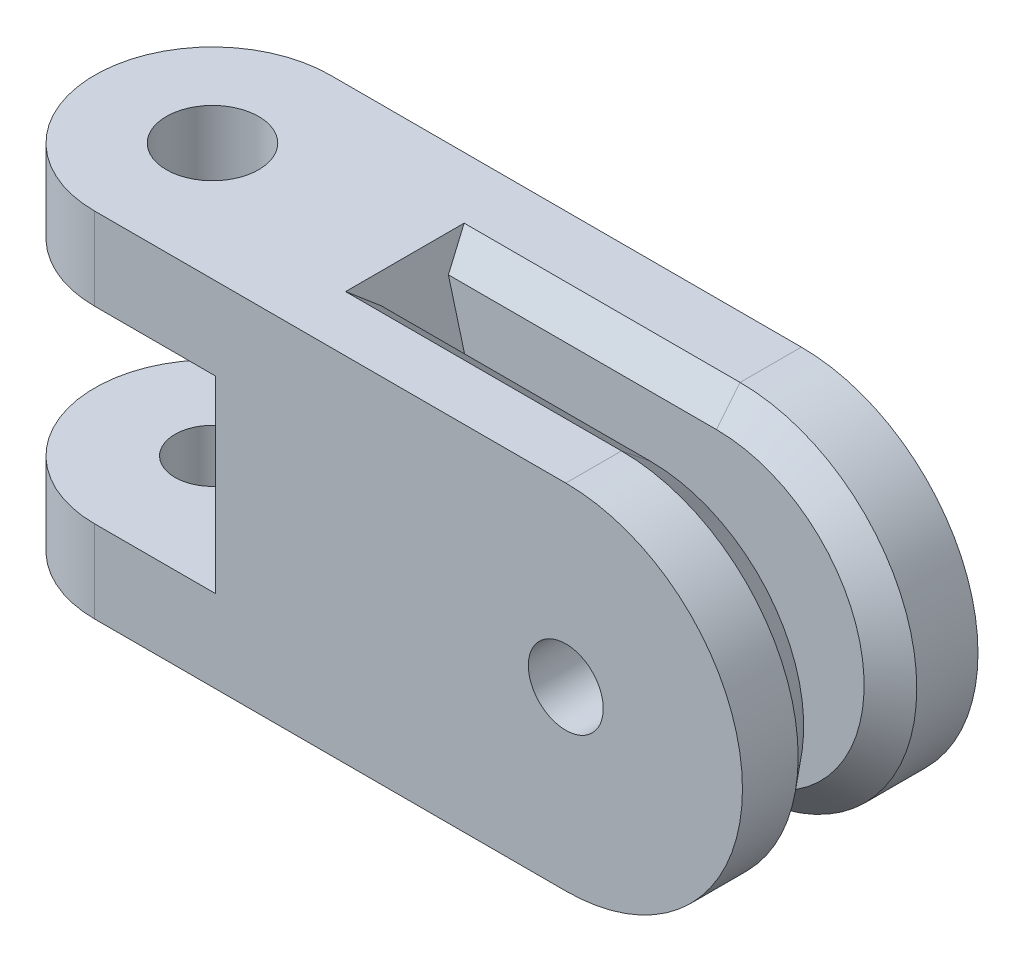
ISO-10303-21;
HEADER;
FILE_DESCRIPTION(('STEP AP214'),'2;1');
FILE_NAME('part.step','',(''),(''),'','','');
FILE_SCHEMA(('AUTOMOTIVE_DESIGN { 1 0 10303 214 1 1 1 1 }'));
ENDSEC;
DATA;
#1=APPLICATION_CONTEXT('core data for automotive mechanical design processes');
#2=APPLICATION_PROTOCOL_DEFINITION('international standard','automotive_design',2000,#1);
#3=PRODUCT_CONTEXT('',#1,'mechanical');
#4=PRODUCT('Part','Part','',(#3));
#5=PRODUCT_RELATED_PRODUCT_CATEGORY('part','',(#4));
#6=PRODUCT_DEFINITION_FORMATION('','',#4);
#7=PRODUCT_DEFINITION_CONTEXT('part definition',#1,'design');
#8=PRODUCT_DEFINITION('design','',#6,#7);
#9=PRODUCT_DEFINITION_SHAPE('','',#8);
#10=(LENGTH_UNIT() NAMED_UNIT(*) SI_UNIT(.MILLI.,.METRE.));
#11=(NAMED_UNIT(*) PLANE_ANGLE_UNIT() SI_UNIT($,.RADIAN.));
#12=(NAMED_UNIT(*) SI_UNIT($,.STERADIAN.) SOLID_ANGLE_UNIT());
#13=UNCERTAINTY_MEASURE_WITH_UNIT(LENGTH_MEASURE(1.E-05),#10,'distance_accuracy_value','');
#14=(GEOMETRIC_REPRESENTATION_CONTEXT(3) GLOBAL_UNCERTAINTY_ASSIGNED_CONTEXT((#13)) GLOBAL_UNIT_ASSIGNED_CONTEXT((#10,
#11,#12)) REPRESENTATION_CONTEXT('',''));
#15=CARTESIAN_POINT('',(0.,0.,0.));
#16=DIRECTION('',(0.,0.,1.));
#17=DIRECTION('',(1.,0.,0.));
#18=AXIS2_PLACEMENT_3D('',#15,#16,#17);
#19=CARTESIAN_POINT('',(6.35,0.,-38.1));
#20=DIRECTION('',(0.,0.,1.));
#21=DIRECTION('',(1.,0.,0.));
#22=AXIS2_PLACEMENT_3D('',#19,#20,#21);
#23=CYLINDRICAL_SURFACE('',#22,9.525);
#24=DIRECTION('',(0.,0.,1.));
#25=VECTOR('',#24,1.);
#26=CARTESIAN_POINT('',(6.35,9.525,-38.1));
#27=LINE('',#26,#25);
#28=CARTESIAN_POINT('',(6.35,9.525,-6.35));
#29=VERTEX_POINT('',#28);
#30=CARTESIAN_POINT('',(6.35,9.525,-3.048));
#31=VERTEX_POINT('',#30);
#32=EDGE_CURVE('E232',#29,#31,#27,.T.);
#33=ORIENTED_EDGE('',*,*,#32,.T.);
#34=CARTESIAN_POINT('',(6.35,0.,-3.048));
#35=DIRECTION('',(0.,0.,1.));
#36=DIRECTION('',(1.,0.,0.));
#37=AXIS2_PLACEMENT_3D('',#34,#35,#36);
#38=CIRCLE('',#37,9.525);
#39=CARTESIAN_POINT('',(6.35,-9.525,-3.048));
#40=VERTEX_POINT('',#39);
#41=EDGE_CURVE('E288',#31,#40,#38,.F.);
#42=ORIENTED_EDGE('',*,*,#41,.T.);
#43=DIRECTION('',(0.,0.,1.));
#44=VECTOR('',#43,1.);
#45=CARTESIAN_POINT('',(6.35,-9.525,-38.1));
#46=LINE('',#45,#44);
#47=CARTESIAN_POINT('',(6.35,-9.525,-6.35));
#48=VERTEX_POINT('',#47);
#49=EDGE_CURVE('E239',#48,#40,#46,.T.);
#50=ORIENTED_EDGE('',*,*,#49,.F.);
#51=CARTESIAN_POINT('',(6.35,0.,-6.35));
#52=DIRECTION('',(0.,0.,1.));
#53=DIRECTION('',(1.,0.,0.));
#54=AXIS2_PLACEMENT_3D('',#51,#52,#53);
#55=CIRCLE('',#54,9.525);
#56=EDGE_CURVE('E228',#29,#48,#55,.F.);
#57=ORIENTED_EDGE('',*,*,#56,.F.);
#58=EDGE_LOOP('',(#33,#42,#50,#57));
#59=FACE_BOUND('',#58,.T.);
#60=ADVANCED_FACE('F35',(#59),#23,.T.);
#61=CARTESIAN_POINT('',(0.,9.525,-6.35));
#62=DIRECTION('',(0.,0.,1.));
#63=DIRECTION('',(1.,0.,0.));
#64=AXIS2_PLACEMENT_3D('',#61,#62,#63);
#65=PLANE('',#64);
#66=CARTESIAN_POINT('',(6.35,0.,-6.35));
#67=DIRECTION('',(0.,0.,-1.));
#68=DIRECTION('',(-1.,0.,0.));
#69=AXIS2_PLACEMENT_3D('',#66,#67,#68);
#70=CIRCLE('',#69,2.48919999999999);
#71=CARTESIAN_POINT('',(3.86080000000001,0.,-6.35));
#72=VERTEX_POINT('',#71);
#73=EDGE_CURVE('E314',#72,#72,#70,.T.);
#74=ORIENTED_EDGE('',*,*,#73,.F.);
#75=EDGE_LOOP('',(#74));
#76=FACE_BOUND('',#75,.T.);
#77=DIRECTION('',(-1.,0.,0.));
#78=VECTOR('',#77,1.);
#79=CARTESIAN_POINT('',(-12.526499966,-5.08,-6.35));
#80=LINE('',#79,#78);
#81=CARTESIAN_POINT('',(-12.526499966,-5.08,-6.35));
#82=VERTEX_POINT('',#81);
#83=CARTESIAN_POINT('',(-19.05,-5.08,-6.35));
#84=VERTEX_POINT('',#83);
#85=EDGE_CURVE('E210',#82,#84,#80,.T.);
#86=ORIENTED_EDGE('',*,*,#85,.F.);
#87=DIRECTION('',(0.,1.,0.));
#88=VECTOR('',#87,1.);
#89=CARTESIAN_POINT('',(-12.526499966,-5.08,-6.35));
#90=LINE('',#89,#88);
#91=CARTESIAN_POINT('',(-12.526499966,5.08,-6.35));
#92=VERTEX_POINT('',#91);
#93=EDGE_CURVE('E222',#82,#92,#90,.T.);
#94=ORIENTED_EDGE('',*,*,#93,.T.);
#95=DIRECTION('',(-1.,0.,0.));
#96=VECTOR('',#95,1.);
#97=CARTESIAN_POINT('',(-12.526499966,5.08,-6.35));
#98=LINE('',#97,#96);
#99=CARTESIAN_POINT('',(-19.05,5.08,-6.35));
#100=VERTEX_POINT('',#99);
#101=EDGE_CURVE('E204',#92,#100,#98,.T.);
#102=ORIENTED_EDGE('',*,*,#101,.T.);
#103=DIRECTION('',(0.,-1.,0.));
#104=VECTOR('',#103,1.);
#105=CARTESIAN_POINT('',(-19.05,9.525,-6.35));
#106=LINE('',#105,#104);
#107=CARTESIAN_POINT('',(-19.05,9.525,-6.35));
#108=VERTEX_POINT('',#107);
#109=EDGE_CURVE('E262',#108,#100,#106,.T.);
#110=ORIENTED_EDGE('',*,*,#109,.F.);
#111=DIRECTION('',(-1.,0.,0.));
#112=VECTOR('',#111,1.);
#113=CARTESIAN_POINT('',(0.,9.525,-6.35));
#114=LINE('',#113,#112);
#115=EDGE_CURVE('E242',#29,#108,#114,.T.);
#116=ORIENTED_EDGE('',*,*,#115,.F.);
#117=ORIENTED_EDGE('',*,*,#56,.T.);
#118=DIRECTION('',(-1.,0.,0.));
#119=VECTOR('',#118,1.);
#120=CARTESIAN_POINT('',(0.,-9.525,-6.35));
#121=LINE('',#120,#119);
#122=CARTESIAN_POINT('',(-19.05,-9.525,-6.35));
#123=VERTEX_POINT('',#122);
#124=EDGE_CURVE('E231',#48,#123,#121,.T.);
#125=ORIENTED_EDGE('',*,*,#124,.T.);
#126=EDGE_CURVE('E261',#84,#123,#106,.T.);
#127=ORIENTED_EDGE('',*,*,#126,.F.);
#128=EDGE_LOOP('',(#86,#94,#102,#110,#116,#117,#125,#127));
#129=FACE_BOUND('',#128,.T.);
#130=ADVANCED_FACE('F352',(#76,#129),#65,.F.);
#131=CARTESIAN_POINT('',(-19.05,9.525,0.));
#132=DIRECTION('',(0.,-1.,0.));
#133=DIRECTION('',(0.,0.,-1.));
#134=AXIS2_PLACEMENT_3D('',#131,#132,#133);
#135=CYLINDRICAL_SURFACE('',#134,6.35);
#136=CARTESIAN_POINT('',(-19.05,-5.08,0.));
#137=DIRECTION('',(0.,1.,0.));
#138=DIRECTION('',(0.,0.,1.));
#139=AXIS2_PLACEMENT_3D('',#136,#137,#138);
#140=CIRCLE('',#139,6.35);
#141=CARTESIAN_POINT('',(-19.05,-5.08,6.35));
#142=VERTEX_POINT('',#141);
#143=EDGE_CURVE('E201',#84,#142,#140,.T.);
#144=ORIENTED_EDGE('',*,*,#143,.F.);
#145=ORIENTED_EDGE('',*,*,#126,.T.);
#146=CARTESIAN_POINT('',(-19.05,-9.525,0.));
#147=DIRECTION('',(0.,1.,0.));
#148=DIRECTION('',(0.,0.,1.));
#149=AXIS2_PLACEMENT_3D('',#146,#147,#148);
#150=CIRCLE('',#149,6.35);
#151=CARTESIAN_POINT('',(-19.05,-9.525,6.35));
#152=VERTEX_POINT('',#151);
#153=EDGE_CURVE('E253',#123,#152,#150,.T.);
#154=ORIENTED_EDGE('',*,*,#153,.T.);
#155=DIRECTION('',(0.,-1.,0.));
#156=VECTOR('',#155,1.);
#157=CARTESIAN_POINT('',(-19.05,9.525,6.35));
#158=LINE('',#157,#156);
#159=EDGE_CURVE('E250',#142,#152,#158,.T.);
#160=ORIENTED_EDGE('',*,*,#159,.F.);
#161=EDGE_LOOP('',(#144,#145,#154,#160));
#162=FACE_BOUND('',#161,.T.);
#163=ADVANCED_FACE('F348',(#162),#135,.T.);
#164=CARTESIAN_POINT('',(0.,9.525,6.35));
#165=DIRECTION('',(0.,0.,-1.));
#166=DIRECTION('',(-1.,0.,0.));
#167=AXIS2_PLACEMENT_3D('',#164,#165,#166);
#168=PLANE('',#167);
#169=CARTESIAN_POINT('',(6.35,0.,6.35));
#170=DIRECTION('',(0.,0.,-1.));
#171=DIRECTION('',(-1.,0.,0.));
#172=AXIS2_PLACEMENT_3D('',#169,#170,#171);
#173=CIRCLE('',#172,2.0193);
#174=CARTESIAN_POINT('',(4.3307,0.,6.35));
#175=VERTEX_POINT('',#174);
#176=EDGE_CURVE('E607',#175,#175,#173,.T.);
#177=ORIENTED_EDGE('',*,*,#176,.T.);
#178=EDGE_LOOP('',(#177));
#179=FACE_BOUND('',#178,.T.);
#180=DIRECTION('',(1.,0.,0.));
#181=VECTOR('',#180,1.);
#182=CARTESIAN_POINT('',(-19.05,-5.08,6.35));
#183=LINE('',#182,#181);
#184=CARTESIAN_POINT('',(-12.526499966,-5.08,6.35));
#185=VERTEX_POINT('',#184);
#186=EDGE_CURVE('E203',#142,#185,#183,.T.);
#187=ORIENTED_EDGE('',*,*,#186,.F.);
#188=ORIENTED_EDGE('',*,*,#159,.T.);
#189=DIRECTION('',(1.,0.,0.));
#190=VECTOR('',#189,1.);
#191=CARTESIAN_POINT('',(0.,-9.525,6.35));
#192=LINE('',#191,#190);
#193=CARTESIAN_POINT('',(6.35,-9.525,6.35));
#194=VERTEX_POINT('',#193);
#195=EDGE_CURVE('E245',#152,#194,#192,.T.);
#196=ORIENTED_EDGE('',*,*,#195,.T.);
#197=CARTESIAN_POINT('',(6.35,0.,6.35));
#198=DIRECTION('',(0.,0.,1.));
#199=DIRECTION('',(1.,0.,0.));
#200=AXIS2_PLACEMENT_3D('',#197,#198,#199);
#201=CIRCLE('',#200,9.525);
#202=CARTESIAN_POINT('',(6.35,9.525,6.35));
#203=VERTEX_POINT('',#202);
#204=EDGE_CURVE('E225',#194,#203,#201,.T.);
#205=ORIENTED_EDGE('',*,*,#204,.T.);
#206=DIRECTION('',(1.,0.,0.));
#207=VECTOR('',#206,1.);
#208=CARTESIAN_POINT('',(0.,9.525,6.35));
#209=LINE('',#208,#207);
#210=CARTESIAN_POINT('',(-19.05,9.525,6.35));
#211=VERTEX_POINT('',#210);
#212=EDGE_CURVE('E247',#211,#203,#209,.T.);
#213=ORIENTED_EDGE('',*,*,#212,.F.);
#214=CARTESIAN_POINT('',(-19.05,5.08,6.35));
#215=VERTEX_POINT('',#214);
#216=EDGE_CURVE('E258',#211,#215,#158,.T.);
#217=ORIENTED_EDGE('',*,*,#216,.T.);
#218=DIRECTION('',(1.,0.,0.));
#219=VECTOR('',#218,1.);
#220=CARTESIAN_POINT('',(-19.05,5.08,6.35));
#221=LINE('',#220,#219);
#222=CARTESIAN_POINT('',(-12.526499966,5.08,6.35));
#223=VERTEX_POINT('',#222);
#224=EDGE_CURVE('E215',#215,#223,#221,.T.);
#225=ORIENTED_EDGE('',*,*,#224,.T.);
#226=DIRECTION('',(0.,1.,0.));
#227=VECTOR('',#226,1.);
#228=CARTESIAN_POINT('',(-12.526499966,-5.08,6.35));
#229=LINE('',#228,#227);
#230=EDGE_CURVE('E212',#185,#223,#229,.T.);
#231=ORIENTED_EDGE('',*,*,#230,.F.);
#232=EDGE_LOOP('',(#187,#188,#196,#205,#213,#217,#225,#231));
#233=FACE_BOUND('',#232,.T.);
#234=ADVANCED_FACE('F343',(#179,#233),#168,.F.);
#235=ORIENTED_EDGE('',*,*,#109,.T.);
#236=CARTESIAN_POINT('',(-19.05,5.08,0.));
#237=DIRECTION('',(0.,1.,0.));
#238=DIRECTION('',(0.,0.,1.));
#239=AXIS2_PLACEMENT_3D('',#236,#237,#238);
#240=CIRCLE('',#239,6.35);
#241=EDGE_CURVE('E200',#100,#215,#240,.T.);
#242=ORIENTED_EDGE('',*,*,#241,.T.);
#243=ORIENTED_EDGE('',*,*,#216,.F.);
#244=CARTESIAN_POINT('',(-19.05,9.525,0.));
#245=DIRECTION('',(0.,1.,0.));
#246=DIRECTION('',(0.,0.,1.));
#247=AXIS2_PLACEMENT_3D('',#244,#245,#246);
#248=CIRCLE('',#247,6.35);
#249=EDGE_CURVE('E244',#108,#211,#248,.T.);
#250=ORIENTED_EDGE('',*,*,#249,.F.);
#251=EDGE_LOOP('',(#235,#242,#243,#250));
#252=FACE_BOUND('',#251,.T.);
#253=ADVANCED_FACE('F387',(#252),#135,.T.);
#254=CARTESIAN_POINT('',(-19.05,9.525,0.));
#255=DIRECTION('',(0.,1.,0.));
#256=DIRECTION('',(0.,0.,1.));
#257=AXIS2_PLACEMENT_3D('',#254,#255,#256);
#258=PLANE('',#257);
#259=CARTESIAN_POINT('',(6.35,9.525,3.34631938879951));
#260=VERTEX_POINT('',#259);
#261=EDGE_CURVE('E238',#260,#203,#27,.T.);
#262=ORIENTED_EDGE('',*,*,#261,.F.);
#263=DIRECTION('',(-1.,0.,0.));
#264=VECTOR('',#263,1.);
#265=CARTESIAN_POINT('',(-8.528473080914,9.525,3.34631938879951));
#266=LINE('',#265,#264);
#267=CARTESIAN_POINT('',(-8.528473080914,9.525,3.34631938879951));
#268=VERTEX_POINT('',#267);
#269=EDGE_CURVE('E278',#260,#268,#266,.T.);
#270=ORIENTED_EDGE('',*,*,#269,.T.);
#271=DIRECTION('',(0.,0.,-1.));
#272=VECTOR('',#271,1.);
#273=CARTESIAN_POINT('',(-8.528473080914,9.525,1.778));
#274=LINE('',#273,#272);
#275=CARTESIAN_POINT('',(-8.528473080914,9.525,-3.04800000000001));
#276=VERTEX_POINT('',#275);
#277=EDGE_CURVE('E178',#268,#276,#274,.T.);
#278=ORIENTED_EDGE('',*,*,#277,.T.);
#279=DIRECTION('',(1.,0.,0.));
#280=VECTOR('',#279,1.);
#281=CARTESIAN_POINT('',(-19.05,9.525,-3.04800000000001));
#282=LINE('',#281,#280);
#283=EDGE_CURVE('E276',#276,#31,#282,.T.);
#284=ORIENTED_EDGE('',*,*,#283,.T.);
#285=ORIENTED_EDGE('',*,*,#32,.F.);
#286=ORIENTED_EDGE('',*,*,#115,.T.);
#287=ORIENTED_EDGE('',*,*,#249,.T.);
#288=ORIENTED_EDGE('',*,*,#212,.T.);
#289=EDGE_LOOP('',(#262,#270,#278,#284,#285,#286,#287,#288));
#290=FACE_BOUND('',#289,.T.);
#291=CARTESIAN_POINT('',(-19.05,9.525,0.));
#292=DIRECTION('',(0.,1.,0.));
#293=DIRECTION('',(0.,0.,1.));
#294=AXIS2_PLACEMENT_3D('',#291,#292,#293);
#295=CIRCLE('',#294,2.48919999999999);
#296=CARTESIAN_POINT('',(-19.05,9.525,2.48919999999999));
#297=VERTEX_POINT('',#296);
#298=EDGE_CURVE('E183',#297,#297,#295,.T.);
#299=ORIENTED_EDGE('',*,*,#298,.F.);
#300=EDGE_LOOP('',(#299));
#301=FACE_BOUND('',#300,.T.);
#302=ADVANCED_FACE('F318',(#290,#301),#258,.T.);
#303=CARTESIAN_POINT('',(-19.05,-9.525,0.));
#304=DIRECTION('',(0.,1.,0.));
#305=DIRECTION('',(0.,0.,1.));
#306=AXIS2_PLACEMENT_3D('',#303,#304,#305);
#307=PLANE('',#306);
#308=CARTESIAN_POINT('',(-19.05,-9.525,0.));
#309=DIRECTION('',(0.,1.,0.));
#310=DIRECTION('',(0.,0.,1.));
#311=AXIS2_PLACEMENT_3D('',#308,#309,#310);
#312=CIRCLE('',#311,2.0193);
#313=CARTESIAN_POINT('',(-19.05,-9.525,2.0193));
#314=VERTEX_POINT('',#313);
#315=EDGE_CURVE('E197',#314,#314,#312,.T.);
#316=ORIENTED_EDGE('',*,*,#315,.T.);
#317=EDGE_LOOP('',(#316));
#318=FACE_BOUND('',#317,.T.);
#319=DIRECTION('',(0.,0.,-1.));
#320=VECTOR('',#319,1.);
#321=CARTESIAN_POINT('',(-8.528473080914,-9.525,1.778));
#322=LINE('',#321,#320);
#323=CARTESIAN_POINT('',(-8.528473080914,-9.525,3.34631938879951));
#324=VERTEX_POINT('',#323);
#325=CARTESIAN_POINT('',(-8.528473080914,-9.525,-3.04800000000001));
#326=VERTEX_POINT('',#325);
#327=EDGE_CURVE('E184',#324,#326,#322,.T.);
#328=ORIENTED_EDGE('',*,*,#327,.F.);
#329=DIRECTION('',(1.,0.,0.));
#330=VECTOR('',#329,1.);
#331=CARTESIAN_POINT('',(-19.05,-9.525,3.34631938879951));
#332=LINE('',#331,#330);
#333=CARTESIAN_POINT('',(6.35,-9.525,3.34631938879951));
#334=VERTEX_POINT('',#333);
#335=EDGE_CURVE('E268',#324,#334,#332,.T.);
#336=ORIENTED_EDGE('',*,*,#335,.T.);
#337=EDGE_CURVE('E235',#334,#194,#46,.T.);
#338=ORIENTED_EDGE('',*,*,#337,.T.);
#339=ORIENTED_EDGE('',*,*,#195,.F.);
#340=ORIENTED_EDGE('',*,*,#153,.F.);
#341=ORIENTED_EDGE('',*,*,#124,.F.);
#342=ORIENTED_EDGE('',*,*,#49,.T.);
#343=DIRECTION('',(-1.,0.,0.));
#344=VECTOR('',#343,1.);
#345=CARTESIAN_POINT('',(-8.528473080914,-9.525,-3.04800000000001));
#346=LINE('',#345,#344);
#347=EDGE_CURVE('E265',#40,#326,#346,.T.);
#348=ORIENTED_EDGE('',*,*,#347,.T.);
#349=EDGE_LOOP('',(#328,#336,#338,#339,#340,#341,#342,#348));
#350=FACE_BOUND('',#349,.T.);
#351=ADVANCED_FACE('F336',(#318,#350),#307,.F.);
#352=ORIENTED_EDGE('',*,*,#337,.F.);
#353=CARTESIAN_POINT('',(6.35,0.,3.34631938879951));
#354=DIRECTION('',(0.,0.,1.));
#355=DIRECTION('',(1.,0.,0.));
#356=AXIS2_PLACEMENT_3D('',#353,#354,#355);
#357=CIRCLE('',#356,9.525);
#358=EDGE_CURVE('E281',#334,#260,#357,.T.);
#359=ORIENTED_EDGE('',*,*,#358,.T.);
#360=ORIENTED_EDGE('',*,*,#261,.T.);
#361=ORIENTED_EDGE('',*,*,#204,.F.);
#362=EDGE_LOOP('',(#352,#359,#360,#361));
#363=FACE_BOUND('',#362,.T.);
#364=ADVANCED_FACE('F339',(#363),#23,.T.);
#365=CARTESIAN_POINT('',(-12.526499966,-5.08,6.35));
#366=DIRECTION('',(1.,0.,0.));
#367=DIRECTION('',(0.,0.,-1.));
#368=AXIS2_PLACEMENT_3D('',#365,#366,#367);
#369=PLANE('',#368);
#370=DIRECTION('',(0.,0.,-1.));
#371=VECTOR('',#370,1.);
#372=CARTESIAN_POINT('',(-12.526499966,5.08,6.35));
#373=LINE('',#372,#371);
#374=EDGE_CURVE('E218',#223,#92,#373,.T.);
#375=ORIENTED_EDGE('',*,*,#374,.T.);
#376=ORIENTED_EDGE('',*,*,#93,.F.);
#377=DIRECTION('',(0.,0.,-1.));
#378=VECTOR('',#377,1.);
#379=CARTESIAN_POINT('',(-12.526499966,-5.08,6.35));
#380=LINE('',#379,#378);
#381=EDGE_CURVE('E207',#185,#82,#380,.T.);
#382=ORIENTED_EDGE('',*,*,#381,.F.);
#383=ORIENTED_EDGE('',*,*,#230,.T.);
#384=EDGE_LOOP('',(#375,#376,#382,#383));
#385=FACE_BOUND('',#384,.T.);
#386=ADVANCED_FACE('F375',(#385),#369,.F.);
#387=CARTESIAN_POINT('',(-19.05,-5.08,0.));
#388=DIRECTION('',(0.,1.,0.));
#389=DIRECTION('',(0.,0.,1.));
#390=AXIS2_PLACEMENT_3D('',#387,#388,#389);
#391=PLANE('',#390);
#392=CARTESIAN_POINT('',(-19.05,-5.08,0.));
#393=DIRECTION('',(0.,1.,0.));
#394=DIRECTION('',(0.,0.,1.));
#395=AXIS2_PLACEMENT_3D('',#392,#393,#394);
#396=CIRCLE('',#395,2.01929999999999);
#397=CARTESIAN_POINT('',(-19.05,-5.08,2.01929999999999));
#398=VERTEX_POINT('',#397);
#399=EDGE_CURVE('E194',#398,#398,#396,.T.);
#400=ORIENTED_EDGE('',*,*,#399,.F.);
#401=EDGE_LOOP('',(#400));
#402=FACE_BOUND('',#401,.T.);
#403=ORIENTED_EDGE('',*,*,#143,.T.);
#404=ORIENTED_EDGE('',*,*,#186,.T.);
#405=ORIENTED_EDGE('',*,*,#381,.T.);
#406=ORIENTED_EDGE('',*,*,#85,.T.);
#407=EDGE_LOOP('',(#403,#404,#405,#406));
#408=FACE_BOUND('',#407,.T.);
#409=ADVANCED_FACE('F380',(#402,#408),#391,.T.);
#410=CARTESIAN_POINT('',(-19.05,5.08,0.));
#411=DIRECTION('',(0.,1.,0.));
#412=DIRECTION('',(0.,0.,1.));
#413=AXIS2_PLACEMENT_3D('',#410,#411,#412);
#414=PLANE('',#413);
#415=CARTESIAN_POINT('',(-19.05,5.08,0.));
#416=DIRECTION('',(0.,1.,0.));
#417=DIRECTION('',(0.,0.,1.));
#418=AXIS2_PLACEMENT_3D('',#415,#416,#417);
#419=CIRCLE('',#418,2.48919999999999);
#420=CARTESIAN_POINT('',(-19.05,5.08,2.4892));
#421=VERTEX_POINT('',#420);
#422=EDGE_CURVE('E187',#421,#421,#419,.T.);
#423=ORIENTED_EDGE('',*,*,#422,.T.);
#424=EDGE_LOOP('',(#423));
#425=FACE_BOUND('',#424,.T.);
#426=ORIENTED_EDGE('',*,*,#241,.F.);
#427=ORIENTED_EDGE('',*,*,#101,.F.);
#428=ORIENTED_EDGE('',*,*,#374,.F.);
#429=ORIENTED_EDGE('',*,*,#224,.F.);
#430=EDGE_LOOP('',(#426,#427,#428,#429));
#431=FACE_BOUND('',#430,.T.);
#432=ADVANCED_FACE('F430',(#425,#431),#414,.F.);
#433=CARTESIAN_POINT('',(-19.05,-5.08,0.));
#434=DIRECTION('',(0.,1.,0.));
#435=DIRECTION('',(0.,0.,1.));
#436=AXIS2_PLACEMENT_3D('',#433,#434,#435);
#437=CYLINDRICAL_SURFACE('',#436,2.01929999999999);
#438=ORIENTED_EDGE('',*,*,#315,.F.);
#439=EDGE_LOOP('',(#438));
#440=FACE_BOUND('',#439,.T.);
#441=ORIENTED_EDGE('',*,*,#399,.T.);
#442=EDGE_LOOP('',(#441));
#443=FACE_BOUND('',#442,.T.);
#444=ADVANCED_FACE('F426',(#440,#443),#437,.F.);
#445=CARTESIAN_POINT('',(-19.05,9.525,0.));
#446=DIRECTION('',(0.,1.,0.));
#447=DIRECTION('',(0.,0.,1.));
#448=AXIS2_PLACEMENT_3D('',#445,#446,#447);
#449=CYLINDRICAL_SURFACE('',#448,2.48919999999999);
#450=ORIENTED_EDGE('',*,*,#298,.T.);
#451=EDGE_LOOP('',(#450));
#452=FACE_BOUND('',#451,.T.);
#453=ORIENTED_EDGE('',*,*,#422,.F.);
#454=EDGE_LOOP('',(#453));
#455=FACE_BOUND('',#454,.T.);
#456=ADVANCED_FACE('F423',(#452,#455),#449,.F.);
#457=CARTESIAN_POINT('',(-8.528473080914,9.525,1.778));
#458=DIRECTION('',(0.965925826289068,0.258819045102522,0.));
#459=DIRECTION('',(-0.258819045102522,0.965925826289068,0.));
#460=AXIS2_PLACEMENT_3D('',#457,#458,#459);
#461=PLANE('',#460);
#462=DIRECTION('',(0.258819045102522,-0.965925826289068,0.));
#463=VECTOR('',#462,1.);
#464=CARTESIAN_POINT('',(-8.528473080914,9.525,-1.778));
#465=LINE('',#464,#463);
#466=CARTESIAN_POINT('',(-8.1082431672111,7.95668061120049,-1.778));
#467=VERTEX_POINT('',#466);
#468=CARTESIAN_POINT('',(-5.97625702300755,0.,-1.778));
#469=VERTEX_POINT('',#468);
#470=EDGE_CURVE('E309',#467,#469,#465,.T.);
#471=ORIENTED_EDGE('',*,*,#470,.F.);
#472=DIRECTION('',(0.203862583152786,-0.760825518088428,0.616104356595332));
#473=VECTOR('',#472,1.);
#474=CARTESIAN_POINT('',(-7.50735926347026,5.71415135298934,0.0379643872720403));
#475=LINE('',#474,#473);
#476=EDGE_CURVE('E11',#467,#276,#475,.F.);
#477=ORIENTED_EDGE('',*,*,#476,.T.);
#478=ORIENTED_EDGE('',*,*,#277,.F.);
#479=DIRECTION('',(0.166278423182741,-0.620559523520427,-0.766327191056119));
#480=VECTOR('',#479,1.);
#481=CARTESIAN_POINT('',(-8.81937766540753,10.6106706894846,4.68701103617745));
#482=LINE('',#481,#480);
#483=CARTESIAN_POINT('',(-8.18817760652648,8.255,1.778));
#484=VERTEX_POINT('',#483);
#485=EDGE_CURVE('E165',#268,#484,#482,.T.);
#486=ORIENTED_EDGE('',*,*,#485,.T.);
#487=DIRECTION('',(0.258819045102522,-0.965925826289068,0.));
#488=VECTOR('',#487,1.);
#489=CARTESIAN_POINT('',(-8.528473080914,9.525,1.778));
#490=LINE('',#489,#488);
#491=CARTESIAN_POINT('',(-5.97625702300755,0.,1.778));
#492=VERTEX_POINT('',#491);
#493=EDGE_CURVE('E158',#484,#492,#490,.T.);
#494=ORIENTED_EDGE('',*,*,#493,.T.);
#495=DIRECTION('',(0.,0.,-1.));
#496=VECTOR('',#495,1.);
#497=CARTESIAN_POINT('',(-5.97625702300755,0.,1.778));
#498=LINE('',#497,#496);
#499=EDGE_CURVE('E163',#492,#469,#498,.T.);
#500=ORIENTED_EDGE('',*,*,#499,.T.);
#501=EDGE_LOOP('',(#471,#477,#478,#486,#494,#500));
#502=FACE_BOUND('',#501,.T.);
#503=ADVANCED_FACE('F161',(#502),#461,.T.);
#504=CARTESIAN_POINT('',(-5.97625702300755,0.,1.778));
#505=DIRECTION('',(0.965925826289068,-0.258819045102521,0.));
#506=DIRECTION('',(0.258819045102521,0.965925826289068,0.));
#507=AXIS2_PLACEMENT_3D('',#504,#505,#506);
#508=PLANE('',#507);
#509=DIRECTION('',(-0.258819045102521,-0.965925826289068,0.));
#510=VECTOR('',#509,1.);
#511=CARTESIAN_POINT('',(-5.97625702300755,0.,-1.778));
#512=LINE('',#511,#510);
#513=CARTESIAN_POINT('',(-8.1082431672111,-7.95668061120049,-1.778));
#514=VERTEX_POINT('',#513);
#515=EDGE_CURVE('E169',#469,#514,#512,.T.);
#516=ORIENTED_EDGE('',*,*,#515,.F.);
#517=ORIENTED_EDGE('',*,*,#499,.F.);
#518=DIRECTION('',(-0.258819045102521,-0.965925826289068,0.));
#519=VECTOR('',#518,1.);
#520=CARTESIAN_POINT('',(-5.97625702300755,0.,1.778));
#521=LINE('',#520,#519);
#522=CARTESIAN_POINT('',(-8.18817760652647,-8.255,1.778));
#523=VERTEX_POINT('',#522);
#524=EDGE_CURVE('E168',#492,#523,#521,.T.);
#525=ORIENTED_EDGE('',*,*,#524,.T.);
#526=DIRECTION('',(0.166278423182741,0.620559523520428,-0.766327191056119));
#527=VECTOR('',#526,1.);
#528=CARTESIAN_POINT('',(-8.81937766540753,-10.6106706894846,4.68701103617744));
#529=LINE('',#528,#527);
#530=EDGE_CURVE('E290',#523,#324,#529,.F.);
#531=ORIENTED_EDGE('',*,*,#530,.T.);
#532=ORIENTED_EDGE('',*,*,#327,.T.);
#533=DIRECTION('',(0.203862583152785,0.760825518088428,0.616104356595332));
#534=VECTOR('',#533,1.);
#535=CARTESIAN_POINT('',(-7.50735926347025,-5.71415135298935,0.0379643872720366));
#536=LINE('',#535,#534);
#537=EDGE_CURVE('E44',#326,#514,#536,.T.);
#538=ORIENTED_EDGE('',*,*,#537,.T.);
#539=EDGE_LOOP('',(#516,#517,#525,#531,#532,#538));
#540=FACE_BOUND('',#539,.T.);
#541=ADVANCED_FACE('F181',(#540),#508,.T.);
#542=CARTESIAN_POINT('',(6.35,0.,1.778));
#543=DIRECTION('',(0.,0.,1.));
#544=DIRECTION('',(1.,0.,0.));
#545=AXIS2_PLACEMENT_3D('',#542,#543,#544);
#546=PLANE('',#545);
#547=CARTESIAN_POINT('',(6.35,0.,1.778));
#548=DIRECTION('',(0.,0.,-1.));
#549=DIRECTION('',(-1.,0.,0.));
#550=AXIS2_PLACEMENT_3D('',#547,#548,#549);
#551=CIRCLE('',#550,2.01929999999999);
#552=CARTESIAN_POINT('',(4.33070000000001,0.,1.778));
#553=VERTEX_POINT('',#552);
#554=EDGE_CURVE('E298',#553,#553,#551,.T.);
#555=ORIENTED_EDGE('',*,*,#554,.F.);
#556=EDGE_LOOP('',(#555));
#557=FACE_BOUND('',#556,.T.);
#558=CARTESIAN_POINT('',(6.35,0.,1.778));
#559=DIRECTION('',(0.,0.,1.));
#560=DIRECTION('',(1.,0.,0.));
#561=AXIS2_PLACEMENT_3D('',#558,#559,#560);
#562=CIRCLE('',#561,8.255);
#563=CARTESIAN_POINT('',(6.35,8.255,1.778));
#564=VERTEX_POINT('',#563);
#565=CARTESIAN_POINT('',(6.35,-8.255,1.778));
#566=VERTEX_POINT('',#565);
#567=EDGE_CURVE('E271',#564,#566,#562,.F.);
#568=ORIENTED_EDGE('',*,*,#567,.T.);
#569=DIRECTION('',(-1.,0.,0.));
#570=VECTOR('',#569,1.);
#571=CARTESIAN_POINT('',(6.35,-8.255,1.778));
#572=LINE('',#571,#570);
#573=EDGE_CURVE('E174',#566,#523,#572,.T.);
#574=ORIENTED_EDGE('',*,*,#573,.T.);
#575=ORIENTED_EDGE('',*,*,#524,.F.);
#576=ORIENTED_EDGE('',*,*,#493,.F.);
#577=DIRECTION('',(1.,0.,0.));
#578=VECTOR('',#577,1.);
#579=CARTESIAN_POINT('',(6.35,8.255,1.778));
#580=LINE('',#579,#578);
#581=EDGE_CURVE('E273',#484,#564,#580,.T.);
#582=ORIENTED_EDGE('',*,*,#581,.T.);
#583=EDGE_LOOP('',(#568,#574,#575,#576,#582));
#584=FACE_BOUND('',#583,.T.);
#585=ADVANCED_FACE('F172',(#557,#584),#546,.F.);
#586=CARTESIAN_POINT('',(6.35,0.,-1.778));
#587=DIRECTION('',(0.,0.,1.));
#588=DIRECTION('',(1.,0.,0.));
#589=AXIS2_PLACEMENT_3D('',#586,#587,#588);
#590=PLANE('',#589);
#591=ORIENTED_EDGE('',*,*,#515,.T.);
#592=DIRECTION('',(1.,0.,0.));
#593=VECTOR('',#592,1.);
#594=CARTESIAN_POINT('',(6.35,-7.95668061120049,-1.778));
#595=LINE('',#594,#593);
#596=CARTESIAN_POINT('',(6.35,-7.95668061120049,-1.778));
#597=VERTEX_POINT('',#596);
#598=EDGE_CURVE('E286',#514,#597,#595,.T.);
#599=ORIENTED_EDGE('',*,*,#598,.T.);
#600=CARTESIAN_POINT('',(6.35,0.,-1.778));
#601=DIRECTION('',(0.,0.,1.));
#602=DIRECTION('',(1.,0.,0.));
#603=AXIS2_PLACEMENT_3D('',#600,#601,#602);
#604=CIRCLE('',#603,7.95668061120049);
#605=CARTESIAN_POINT('',(6.35,7.95668061120049,-1.778));
#606=VERTEX_POINT('',#605);
#607=EDGE_CURVE('E52',#597,#606,#604,.T.);
#608=ORIENTED_EDGE('',*,*,#607,.T.);
#609=DIRECTION('',(-1.,0.,0.));
#610=VECTOR('',#609,1.);
#611=CARTESIAN_POINT('',(6.35,7.95668061120049,-1.778));
#612=LINE('',#611,#610);
#613=EDGE_CURVE('E284',#606,#467,#612,.T.);
#614=ORIENTED_EDGE('',*,*,#613,.T.);
#615=ORIENTED_EDGE('',*,*,#470,.T.);
#616=EDGE_LOOP('',(#591,#599,#608,#614,#615));
#617=FACE_BOUND('',#616,.T.);
#618=CARTESIAN_POINT('',(6.35,0.,-1.778));
#619=DIRECTION('',(0.,0.,1.));
#620=DIRECTION('',(1.,0.,0.));
#621=AXIS2_PLACEMENT_3D('',#618,#619,#620);
#622=CIRCLE('',#621,2.48919999999999);
#623=CARTESIAN_POINT('',(8.83919999999999,0.,-1.778));
#624=VERTEX_POINT('',#623);
#625=EDGE_CURVE('E310',#624,#624,#622,.T.);
#626=ORIENTED_EDGE('',*,*,#625,.F.);
#627=EDGE_LOOP('',(#626));
#628=FACE_BOUND('',#627,.T.);
#629=ADVANCED_FACE('F307',(#617,#628),#590,.T.);
#630=CARTESIAN_POINT('',(6.35,0.,-6.35));
#631=DIRECTION('',(0.,0.,-1.));
#632=DIRECTION('',(-1.,0.,0.));
#633=AXIS2_PLACEMENT_3D('',#630,#631,#632);
#634=CYLINDRICAL_SURFACE('',#633,2.48919999999999);
#635=ORIENTED_EDGE('',*,*,#625,.T.);
#636=EDGE_LOOP('',(#635));
#637=FACE_BOUND('',#636,.T.);
#638=ORIENTED_EDGE('',*,*,#73,.T.);
#639=EDGE_LOOP('',(#638));
#640=FACE_BOUND('',#639,.T.);
#641=ADVANCED_FACE('F403',(#637,#640),#634,.F.);
#642=CARTESIAN_POINT('',(6.35,0.,1.778));
#643=DIRECTION('',(0.,0.,-1.));
#644=DIRECTION('',(-1.,0.,0.));
#645=AXIS2_PLACEMENT_3D('',#642,#643,#644);
#646=CYLINDRICAL_SURFACE('',#645,2.01929999999999);
#647=ORIENTED_EDGE('',*,*,#176,.F.);
#648=EDGE_LOOP('',(#647));
#649=FACE_BOUND('',#648,.T.);
#650=ORIENTED_EDGE('',*,*,#554,.T.);
#651=EDGE_LOOP('',(#650));
#652=FACE_BOUND('',#651,.T.);
#653=ADVANCED_FACE('F399',(#649,#652),#646,.F.);
#654=CARTESIAN_POINT('',(-19.05,9.525,3.34631938879951));
#655=DIRECTION('',(0.,0.777145961456969,-0.629320391049839));
#656=DIRECTION('',(1.,0.,0.));
#657=AXIS2_PLACEMENT_3D('',#654,#655,#656);
#658=PLANE('',#657);
#659=ORIENTED_EDGE('',*,*,#485,.F.);
#660=ORIENTED_EDGE('',*,*,#269,.F.);
#661=DIRECTION('',(0.,0.629320391049839,0.777145961456969));
#662=VECTOR('',#661,1.);
#663=CARTESIAN_POINT('',(6.35,8.255,1.778));
#664=LINE('',#663,#662);
#665=EDGE_CURVE('E296',#564,#260,#664,.T.);
#666=ORIENTED_EDGE('',*,*,#665,.F.);
#667=ORIENTED_EDGE('',*,*,#581,.F.);
#668=EDGE_LOOP('',(#659,#660,#666,#667));
#669=FACE_BOUND('',#668,.T.);
#670=ADVANCED_FACE('F324',(#669),#658,.T.);
#671=CARTESIAN_POINT('',(6.35,0.,3.34631938879951));
#672=DIRECTION('',(0.,0.,1.));
#673=DIRECTION('',(1.,0.,0.));
#674=AXIS2_PLACEMENT_3D('',#671,#672,#673);
#675=CONICAL_SURFACE('',#674,9.525,0.680678408277792);
#676=ORIENTED_EDGE('',*,*,#665,.T.);
#677=ORIENTED_EDGE('',*,*,#358,.F.);
#678=DIRECTION('',(0.,-0.62932039104984,0.777145961456969));
#679=VECTOR('',#678,1.);
#680=CARTESIAN_POINT('',(6.35,-8.255,1.778));
#681=LINE('',#680,#679);
#682=EDGE_CURVE('E294',#566,#334,#681,.T.);
#683=ORIENTED_EDGE('',*,*,#682,.F.);
#684=ORIENTED_EDGE('',*,*,#567,.F.);
#685=EDGE_LOOP('',(#676,#677,#683,#684));
#686=FACE_BOUND('',#685,.T.);
#687=ADVANCED_FACE('F332',(#686),#675,.T.);
#688=CARTESIAN_POINT('',(-19.05,-9.525,3.34631938879951));
#689=DIRECTION('',(0.,0.777145961456969,0.629320391049839));
#690=DIRECTION('',(1.,0.,0.));
#691=AXIS2_PLACEMENT_3D('',#688,#689,#690);
#692=PLANE('',#691);
#693=ORIENTED_EDGE('',*,*,#530,.F.);
#694=ORIENTED_EDGE('',*,*,#573,.F.);
#695=ORIENTED_EDGE('',*,*,#682,.T.);
#696=ORIENTED_EDGE('',*,*,#335,.F.);
#697=EDGE_LOOP('',(#693,#694,#695,#696));
#698=FACE_BOUND('',#697,.T.);
#699=ADVANCED_FACE('F329',(#698),#692,.F.);
#700=CARTESIAN_POINT('',(6.35,7.95668061120049,-1.778));
#701=DIRECTION('',(0.,-0.62932039104984,-0.777145961456969));
#702=DIRECTION('',(-1.,0.,0.));
#703=AXIS2_PLACEMENT_3D('',#700,#701,#702);
#704=PLANE('',#703);
#705=ORIENTED_EDGE('',*,*,#476,.F.);
#706=ORIENTED_EDGE('',*,*,#613,.F.);
#707=DIRECTION('',(0.,-0.777145961456969,0.62932039104984));
#708=VECTOR('',#707,1.);
#709=CARTESIAN_POINT('',(6.35,9.525,-3.04800000000001));
#710=LINE('',#709,#708);
#711=EDGE_CURVE('E39',#31,#606,#710,.T.);
#712=ORIENTED_EDGE('',*,*,#711,.F.);
#713=ORIENTED_EDGE('',*,*,#283,.F.);
#714=EDGE_LOOP('',(#705,#706,#712,#713));
#715=FACE_BOUND('',#714,.T.);
#716=ADVANCED_FACE('F37',(#715),#704,.F.);
#717=CARTESIAN_POINT('',(6.35,0.,-1.778));
#718=DIRECTION('',(0.,0.,-1.));
#719=DIRECTION('',(-1.,0.,0.));
#720=AXIS2_PLACEMENT_3D('',#717,#718,#719);
#721=CONICAL_SURFACE('',#720,7.95668061120049,0.890117918517107);
#722=ORIENTED_EDGE('',*,*,#711,.T.);
#723=ORIENTED_EDGE('',*,*,#607,.F.);
#724=DIRECTION('',(0.,0.77714596145697,0.629320391049838));
#725=VECTOR('',#724,1.);
#726=CARTESIAN_POINT('',(6.35,-9.525,-3.048));
#727=LINE('',#726,#725);
#728=EDGE_CURVE('E60',#40,#597,#727,.T.);
#729=ORIENTED_EDGE('',*,*,#728,.F.);
#730=ORIENTED_EDGE('',*,*,#41,.F.);
#731=EDGE_LOOP('',(#722,#723,#729,#730));
#732=FACE_BOUND('',#731,.T.);
#733=ADVANCED_FACE('F303',(#732),#721,.T.);
#734=CARTESIAN_POINT('',(6.35,-7.95668061120049,-1.778));
#735=DIRECTION('',(0.,-0.62932039104984,0.777145961456969));
#736=DIRECTION('',(-1.,0.,0.));
#737=AXIS2_PLACEMENT_3D('',#734,#735,#736);
#738=PLANE('',#737);
#739=ORIENTED_EDGE('',*,*,#537,.F.);
#740=ORIENTED_EDGE('',*,*,#347,.F.);
#741=ORIENTED_EDGE('',*,*,#728,.T.);
#742=ORIENTED_EDGE('',*,*,#598,.F.);
#743=EDGE_LOOP('',(#739,#740,#741,#742));
#744=FACE_BOUND('',#743,.T.);
#745=ADVANCED_FACE('F358',(#744),#738,.T.);
#746=CLOSED_SHELL('',(#60,#130,#163,#234,#253,#302,#351,#364,#386,#409,#432,#444,#456,#503,#541,
#585,#629,#641,#653,#670,#687,#699,#716,#733,#745));
#747=MANIFOLD_SOLID_BREP('B2',#746);
#748=ADVANCED_BREP_SHAPE_REPRESENTATION('',(#18,#747),#14);
#749=SHAPE_DEFINITION_REPRESENTATION(#9,#748);
ENDSEC;
END-ISO-10303-21;
